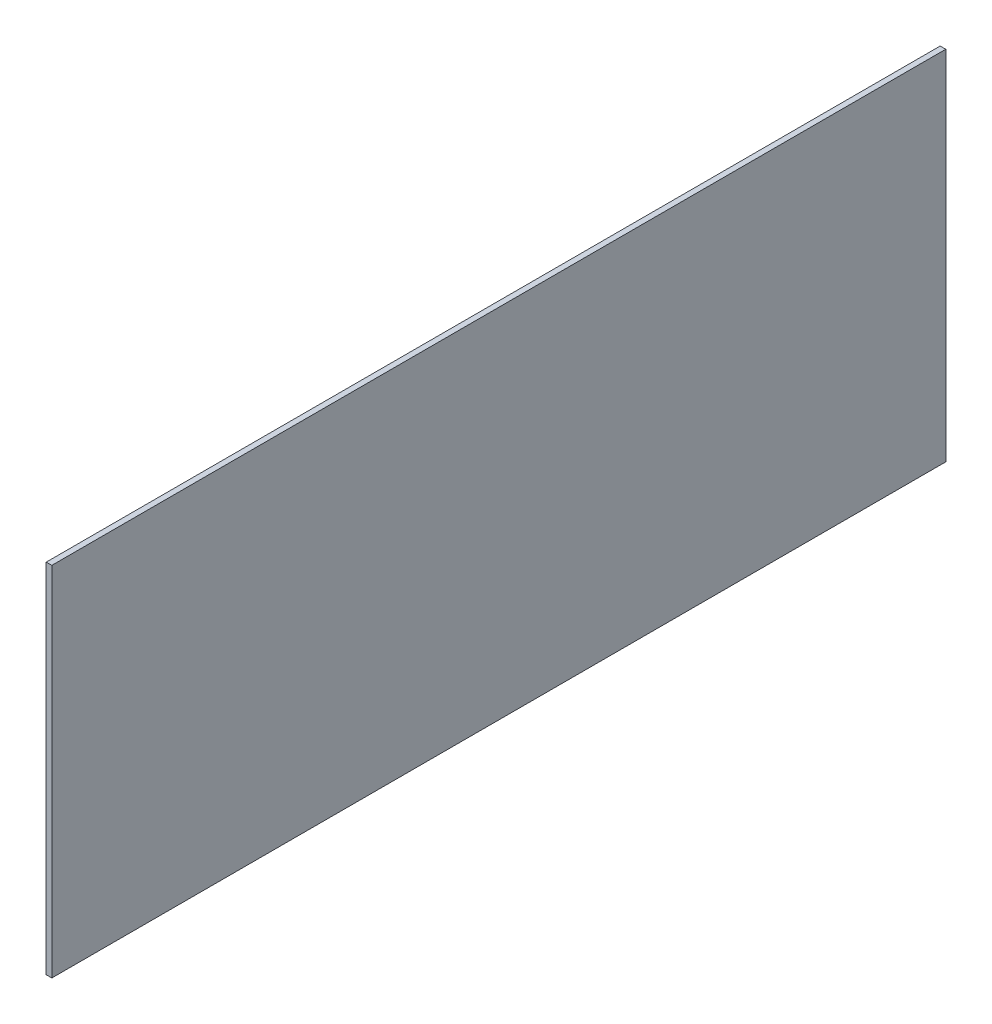
ISO-10303-21;
HEADER;
FILE_DESCRIPTION(('STEP AP214'),'2;1');
FILE_NAME('part.step','',(''),(''),'','','');
FILE_SCHEMA(('AUTOMOTIVE_DESIGN { 1 0 10303 214 1 1 1 1 }'));
ENDSEC;
DATA;
#1=APPLICATION_CONTEXT('core data for automotive mechanical design processes');
#2=APPLICATION_PROTOCOL_DEFINITION('international standard','automotive_design',2000,#1);
#3=PRODUCT_CONTEXT('',#1,'mechanical');
#4=PRODUCT('Part','Part','',(#3));
#5=PRODUCT_RELATED_PRODUCT_CATEGORY('part','',(#4));
#6=PRODUCT_DEFINITION_FORMATION('','',#4);
#7=PRODUCT_DEFINITION_CONTEXT('part definition',#1,'design');
#8=PRODUCT_DEFINITION('design','',#6,#7);
#9=PRODUCT_DEFINITION_SHAPE('','',#8);
#10=(LENGTH_UNIT() NAMED_UNIT(*) SI_UNIT(.MILLI.,.METRE.));
#11=(NAMED_UNIT(*) PLANE_ANGLE_UNIT() SI_UNIT($,.RADIAN.));
#12=(NAMED_UNIT(*) SI_UNIT($,.STERADIAN.) SOLID_ANGLE_UNIT());
#13=UNCERTAINTY_MEASURE_WITH_UNIT(LENGTH_MEASURE(1.E-05),#10,'distance_accuracy_value','');
#14=(GEOMETRIC_REPRESENTATION_CONTEXT(3) GLOBAL_UNCERTAINTY_ASSIGNED_CONTEXT((#13)) GLOBAL_UNIT_ASSIGNED_CONTEXT((#10,
#11,#12)) REPRESENTATION_CONTEXT('',''));
#15=CARTESIAN_POINT('',(0.,0.,0.));
#16=DIRECTION('',(0.,0.,1.));
#17=DIRECTION('',(1.,0.,0.));
#18=AXIS2_PLACEMENT_3D('',#15,#16,#17);
#19=CARTESIAN_POINT('',(-678.259375,25.3999999999997,-1.2490009027033E-13));
#20=DIRECTION('',(0.,0.,-1.));
#21=DIRECTION('',(0.,1.,0.));
#22=AXIS2_PLACEMENT_3D('',#19,#20,#21);
#23=PLANE('',#22);
#24=DIRECTION('',(1.,0.,0.));
#25=VECTOR('',#24,1.);
#26=CARTESIAN_POINT('',(-678.259375,50.8,-1.2490009027033E-13));
#27=LINE('',#26,#25);
#28=CARTESIAN_POINT('',(-678.65625,50.8,-1.2490009027033E-13));
#29=VERTEX_POINT('',#28);
#30=CARTESIAN_POINT('',(-677.8625,50.8,-1.2490009027033E-13));
#31=VERTEX_POINT('',#30);
#32=EDGE_CURVE('E12',#29,#31,#27,.T.);
#33=ORIENTED_EDGE('',*,*,#32,.F.);
#34=DIRECTION('',(0.,1.,0.));
#35=VECTOR('',#34,1.);
#36=CARTESIAN_POINT('',(-678.65625,25.3999999999997,-1.2490009027033E-13));
#37=LINE('',#36,#35);
#38=CARTESIAN_POINT('',(-678.65625,0.,-1.2490009027033E-13));
#39=VERTEX_POINT('',#38);
#40=EDGE_CURVE('E84',#29,#39,#37,.F.);
#41=ORIENTED_EDGE('',*,*,#40,.T.);
#42=DIRECTION('',(1.,0.,0.));
#43=VECTOR('',#42,1.);
#44=CARTESIAN_POINT('',(-678.259375,0.,-1.2490009027033E-13));
#45=LINE('',#44,#43);
#46=CARTESIAN_POINT('',(-677.8625,0.,-1.2490009027033E-13));
#47=VERTEX_POINT('',#46);
#48=EDGE_CURVE('E56',#39,#47,#45,.T.);
#49=ORIENTED_EDGE('',*,*,#48,.T.);
#50=DIRECTION('',(0.,1.,0.));
#51=VECTOR('',#50,1.);
#52=CARTESIAN_POINT('',(-677.8625,25.3999999999997,-1.2490009027033E-13));
#53=LINE('',#52,#51);
#54=EDGE_CURVE('E86',#31,#47,#53,.F.);
#55=ORIENTED_EDGE('',*,*,#54,.F.);
#56=EDGE_LOOP('',(#33,#41,#49,#55));
#57=FACE_BOUND('',#56,.T.);
#58=ADVANCED_FACE('F46',(#57),#23,.F.);
#59=CARTESIAN_POINT('',(-678.259375,0.,-63.5371779859485));
#60=DIRECTION('',(0.,-1.,0.));
#61=DIRECTION('',(0.,0.,-1.));
#62=AXIS2_PLACEMENT_3D('',#59,#60,#61);
#63=PLANE('',#62);
#64=ORIENTED_EDGE('',*,*,#48,.F.);
#65=DIRECTION('',(0.,0.,-1.));
#66=VECTOR('',#65,1.);
#67=CARTESIAN_POINT('',(-678.65625,0.,-63.5371779859485));
#68=LINE('',#67,#66);
#69=CARTESIAN_POINT('',(-678.65625,0.,-127.074355971897));
#70=VERTEX_POINT('',#69);
#71=EDGE_CURVE('E98',#39,#70,#68,.T.);
#72=ORIENTED_EDGE('',*,*,#71,.T.);
#73=DIRECTION('',(1.,0.,0.));
#74=VECTOR('',#73,1.);
#75=CARTESIAN_POINT('',(-678.259375,0.,-127.074355971897));
#76=LINE('',#75,#74);
#77=CARTESIAN_POINT('',(-677.8625,0.,-127.074355971897));
#78=VERTEX_POINT('',#77);
#79=EDGE_CURVE('E107',#70,#78,#76,.T.);
#80=ORIENTED_EDGE('',*,*,#79,.T.);
#81=DIRECTION('',(0.,0.,-1.));
#82=VECTOR('',#81,1.);
#83=CARTESIAN_POINT('',(-677.8625,0.,-63.5371779859485));
#84=LINE('',#83,#82);
#85=EDGE_CURVE('E102',#47,#78,#84,.T.);
#86=ORIENTED_EDGE('',*,*,#85,.F.);
#87=EDGE_LOOP('',(#64,#72,#80,#86));
#88=FACE_BOUND('',#87,.T.);
#89=ADVANCED_FACE('F115',(#88),#63,.T.);
#90=CARTESIAN_POINT('',(-678.259375,25.3999999999997,-127.074355971897));
#91=DIRECTION('',(0.,0.,-1.));
#92=DIRECTION('',(0.,1.,0.));
#93=AXIS2_PLACEMENT_3D('',#90,#91,#92);
#94=PLANE('',#93);
#95=ORIENTED_EDGE('',*,*,#79,.F.);
#96=DIRECTION('',(0.,1.,0.));
#97=VECTOR('',#96,1.);
#98=CARTESIAN_POINT('',(-678.65625,25.3999999999997,-127.074355971897));
#99=LINE('',#98,#97);
#100=CARTESIAN_POINT('',(-678.65625,50.8,-127.074355971897));
#101=VERTEX_POINT('',#100);
#102=EDGE_CURVE('E100',#70,#101,#99,.T.);
#103=ORIENTED_EDGE('',*,*,#102,.T.);
#104=DIRECTION('',(1.,0.,0.));
#105=VECTOR('',#104,1.);
#106=CARTESIAN_POINT('',(-678.259375,50.8,-127.074355971897));
#107=LINE('',#106,#105);
#108=CARTESIAN_POINT('',(-677.8625,50.8,-127.074355971897));
#109=VERTEX_POINT('',#108);
#110=EDGE_CURVE('E50',#101,#109,#107,.T.);
#111=ORIENTED_EDGE('',*,*,#110,.T.);
#112=DIRECTION('',(0.,1.,0.));
#113=VECTOR('',#112,1.);
#114=CARTESIAN_POINT('',(-677.8625,25.3999999999997,-127.074355971897));
#115=LINE('',#114,#113);
#116=EDGE_CURVE('E116',#78,#109,#115,.T.);
#117=ORIENTED_EDGE('',*,*,#116,.F.);
#118=EDGE_LOOP('',(#95,#103,#111,#117));
#119=FACE_BOUND('',#118,.T.);
#120=ADVANCED_FACE('F120',(#119),#94,.T.);
#121=CARTESIAN_POINT('',(-678.259375,50.8,-63.5371779859485));
#122=DIRECTION('',(0.,-1.,0.));
#123=DIRECTION('',(0.,0.,-1.));
#124=AXIS2_PLACEMENT_3D('',#121,#122,#123);
#125=PLANE('',#124);
#126=DIRECTION('',(0.,0.,-1.));
#127=VECTOR('',#126,1.);
#128=CARTESIAN_POINT('',(-678.65625,50.8,-63.5371779859485));
#129=LINE('',#128,#127);
#130=EDGE_CURVE('E96',#101,#29,#129,.F.);
#131=ORIENTED_EDGE('',*,*,#130,.T.);
#132=ORIENTED_EDGE('',*,*,#32,.T.);
#133=DIRECTION('',(0.,0.,-1.));
#134=VECTOR('',#133,1.);
#135=CARTESIAN_POINT('',(-677.8625,50.8,-63.5371779859485));
#136=LINE('',#135,#134);
#137=EDGE_CURVE('E114',#109,#31,#136,.F.);
#138=ORIENTED_EDGE('',*,*,#137,.F.);
#139=ORIENTED_EDGE('',*,*,#110,.F.);
#140=EDGE_LOOP('',(#131,#132,#138,#139));
#141=FACE_BOUND('',#140,.T.);
#142=ADVANCED_FACE('F48',(#141),#125,.F.);
#143=CARTESIAN_POINT('',(-677.8625,25.3999999999997,-63.5371779859485));
#144=DIRECTION('',(1.,0.,0.));
#145=DIRECTION('',(0.,0.,-1.));
#146=AXIS2_PLACEMENT_3D('',#143,#144,#145);
#147=PLANE('',#146);
#148=ORIENTED_EDGE('',*,*,#116,.T.);
#149=ORIENTED_EDGE('',*,*,#137,.T.);
#150=ORIENTED_EDGE('',*,*,#54,.T.);
#151=ORIENTED_EDGE('',*,*,#85,.T.);
#152=EDGE_LOOP('',(#148,#149,#150,#151));
#153=FACE_BOUND('',#152,.T.);
#154=ADVANCED_FACE('F113',(#153),#147,.T.);
#155=CARTESIAN_POINT('',(-678.65625,25.3999999999997,-63.5371779859485));
#156=DIRECTION('',(1.,0.,0.));
#157=DIRECTION('',(0.,0.,-1.));
#158=AXIS2_PLACEMENT_3D('',#155,#156,#157);
#159=PLANE('',#158);
#160=ORIENTED_EDGE('',*,*,#102,.F.);
#161=ORIENTED_EDGE('',*,*,#71,.F.);
#162=ORIENTED_EDGE('',*,*,#40,.F.);
#163=ORIENTED_EDGE('',*,*,#130,.F.);
#164=EDGE_LOOP('',(#160,#161,#162,#163));
#165=FACE_BOUND('',#164,.T.);
#166=ADVANCED_FACE('F95',(#165),#159,.F.);
#167=CLOSED_SHELL('',(#58,#89,#120,#142,#154,#166));
#168=MANIFOLD_SOLID_BREP('B2',#167);
#169=ADVANCED_BREP_SHAPE_REPRESENTATION('',(#18,#168),#14);
#170=SHAPE_DEFINITION_REPRESENTATION(#9,#169);
ENDSEC;
END-ISO-10303-21;
